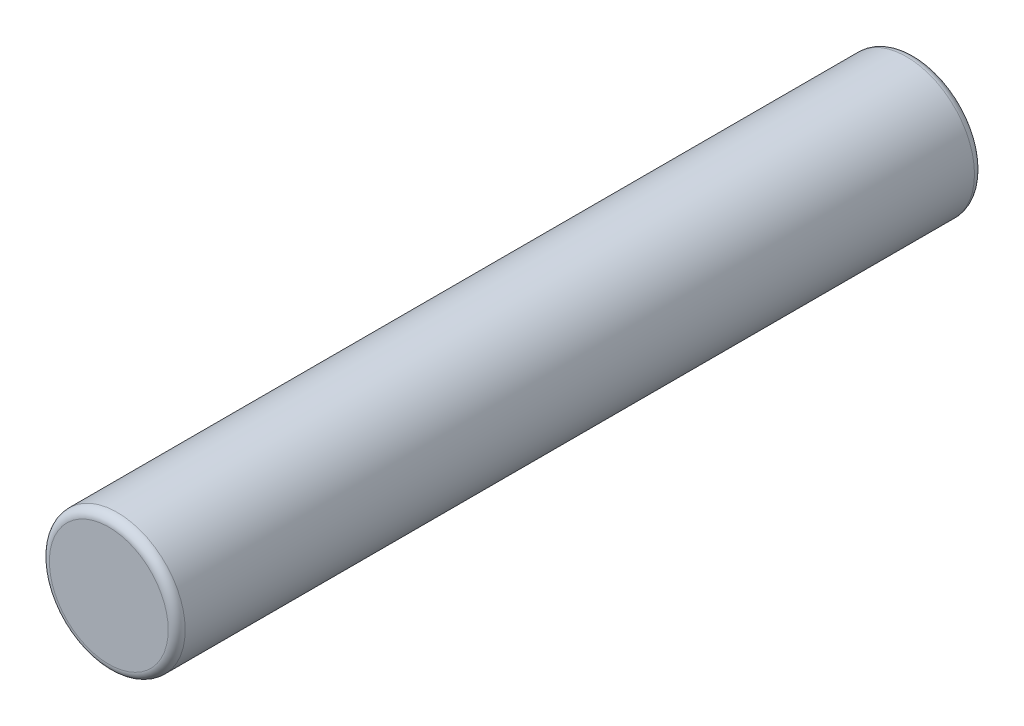
ISO-10303-21;
HEADER;
FILE_DESCRIPTION(('STEP AP214'),'2;1');
FILE_NAME('part.step','',(''),(''),'','','');
FILE_SCHEMA(('AUTOMOTIVE_DESIGN { 1 0 10303 214 1 1 1 1 }'));
ENDSEC;
DATA;
#1=APPLICATION_CONTEXT('core data for automotive mechanical design processes');
#2=APPLICATION_PROTOCOL_DEFINITION('international standard','automotive_design',2000,#1);
#3=PRODUCT_CONTEXT('',#1,'mechanical');
#4=PRODUCT('Part','Part','',(#3));
#5=PRODUCT_RELATED_PRODUCT_CATEGORY('part','',(#4));
#6=PRODUCT_DEFINITION_FORMATION('','',#4);
#7=PRODUCT_DEFINITION_CONTEXT('part definition',#1,'design');
#8=PRODUCT_DEFINITION('design','',#6,#7);
#9=PRODUCT_DEFINITION_SHAPE('','',#8);
#10=(LENGTH_UNIT() NAMED_UNIT(*) SI_UNIT(.MILLI.,.METRE.));
#11=(NAMED_UNIT(*) PLANE_ANGLE_UNIT() SI_UNIT($,.RADIAN.));
#12=(NAMED_UNIT(*) SI_UNIT($,.STERADIAN.) SOLID_ANGLE_UNIT());
#13=UNCERTAINTY_MEASURE_WITH_UNIT(LENGTH_MEASURE(1.E-05),#10,'distance_accuracy_value','');
#14=(GEOMETRIC_REPRESENTATION_CONTEXT(3) GLOBAL_UNCERTAINTY_ASSIGNED_CONTEXT((#13)) GLOBAL_UNIT_ASSIGNED_CONTEXT((#10,
#11,#12)) REPRESENTATION_CONTEXT('',''));
#15=CARTESIAN_POINT('',(0.,0.,0.));
#16=DIRECTION('',(0.,0.,1.));
#17=DIRECTION('',(1.,0.,0.));
#18=AXIS2_PLACEMENT_3D('',#15,#16,#17);
#19=CARTESIAN_POINT('',(0.,0.,9.5));
#20=DIRECTION('',(0.,0.,-1.));
#21=DIRECTION('',(-1.,0.,0.));
#22=AXIS2_PLACEMENT_3D('',#19,#20,#21);
#23=CYLINDRICAL_SURFACE('',#22,0.8);
#24=CARTESIAN_POINT('',(0.,0.,0.0999999999999994));
#25=DIRECTION('',(0.,0.,1.));
#26=DIRECTION('',(1.,0.,0.));
#27=AXIS2_PLACEMENT_3D('',#24,#25,#26);
#28=CIRCLE('',#27,0.8);
#29=CARTESIAN_POINT('',(0.8,0.,0.0999999999999994));
#30=VERTEX_POINT('',#29);
#31=EDGE_CURVE('E46',#30,#30,#28,.T.);
#32=ORIENTED_EDGE('',*,*,#31,.T.);
#33=EDGE_LOOP('',(#32));
#34=FACE_BOUND('',#33,.T.);
#35=CARTESIAN_POINT('',(0.,0.,9.4));
#36=DIRECTION('',(0.,0.,1.));
#37=DIRECTION('',(1.,0.,0.));
#38=AXIS2_PLACEMENT_3D('',#35,#36,#37);
#39=CIRCLE('',#38,0.8);
#40=CARTESIAN_POINT('',(0.8,0.,9.4));
#41=VERTEX_POINT('',#40);
#42=EDGE_CURVE('E50',#41,#41,#39,.F.);
#43=ORIENTED_EDGE('',*,*,#42,.T.);
#44=EDGE_LOOP('',(#43));
#45=FACE_BOUND('',#44,.T.);
#46=ADVANCED_FACE('F35',(#34,#45),#23,.T.);
#47=CARTESIAN_POINT('',(0.,0.,9.5));
#48=DIRECTION('',(0.,0.,1.));
#49=DIRECTION('',(1.,0.,0.));
#50=AXIS2_PLACEMENT_3D('',#47,#48,#49);
#51=PLANE('',#50);
#52=CARTESIAN_POINT('',(0.,0.,9.5));
#53=DIRECTION('',(0.,0.,1.));
#54=DIRECTION('',(1.,0.,0.));
#55=AXIS2_PLACEMENT_3D('',#52,#53,#54);
#56=CIRCLE('',#55,0.7);
#57=CARTESIAN_POINT('',(0.7,0.,9.5));
#58=VERTEX_POINT('',#57);
#59=EDGE_CURVE('E10',#58,#58,#56,.T.);
#60=ORIENTED_EDGE('',*,*,#59,.T.);
#61=EDGE_LOOP('',(#60));
#62=FACE_BOUND('',#61,.T.);
#63=ADVANCED_FACE('F66',(#62),#51,.T.);
#64=CARTESIAN_POINT('',(0.,0.,0.));
#65=DIRECTION('',(0.,0.,1.));
#66=DIRECTION('',(1.,0.,0.));
#67=AXIS2_PLACEMENT_3D('',#64,#65,#66);
#68=PLANE('',#67);
#69=CARTESIAN_POINT('',(0.,0.,0.));
#70=DIRECTION('',(0.,0.,1.));
#71=DIRECTION('',(1.,0.,0.));
#72=AXIS2_PLACEMENT_3D('',#69,#70,#71);
#73=CIRCLE('',#72,0.7);
#74=CARTESIAN_POINT('',(0.7,0.,0.));
#75=VERTEX_POINT('',#74);
#76=EDGE_CURVE('E42',#75,#75,#73,.F.);
#77=ORIENTED_EDGE('',*,*,#76,.T.);
#78=EDGE_LOOP('',(#77));
#79=FACE_BOUND('',#78,.T.);
#80=ADVANCED_FACE('F63',(#79),#68,.F.);
#81=CARTESIAN_POINT('',(0.,0.,0.0999999999999994));
#82=DIRECTION('',(0.,0.,1.));
#83=DIRECTION('',(1.,0.,0.));
#84=AXIS2_PLACEMENT_3D('',#81,#82,#83);
#85=TOROIDAL_SURFACE('',#84,0.7,0.1);
#86=ORIENTED_EDGE('',*,*,#76,.F.);
#87=EDGE_LOOP('',(#86));
#88=FACE_BOUND('',#87,.T.);
#89=ORIENTED_EDGE('',*,*,#31,.F.);
#90=EDGE_LOOP('',(#89));
#91=FACE_BOUND('',#90,.T.);
#92=ADVANCED_FACE('F59',(#88,#91),#85,.T.);
#93=CARTESIAN_POINT('',(0.,0.,9.4));
#94=DIRECTION('',(0.,0.,1.));
#95=DIRECTION('',(1.,0.,0.));
#96=AXIS2_PLACEMENT_3D('',#93,#94,#95);
#97=TOROIDAL_SURFACE('',#96,0.7,0.1);
#98=ORIENTED_EDGE('',*,*,#42,.F.);
#99=EDGE_LOOP('',(#98));
#100=FACE_BOUND('',#99,.T.);
#101=ORIENTED_EDGE('',*,*,#59,.F.);
#102=EDGE_LOOP('',(#101));
#103=FACE_BOUND('',#102,.T.);
#104=ADVANCED_FACE('F37',(#100,#103),#97,.T.);
#105=CLOSED_SHELL('',(#46,#63,#80,#92,#104));
#106=MANIFOLD_SOLID_BREP('B2',#105);
#107=ADVANCED_BREP_SHAPE_REPRESENTATION('',(#18,#106),#14);
#108=SHAPE_DEFINITION_REPRESENTATION(#9,#107);
ENDSEC;
END-ISO-10303-21;
